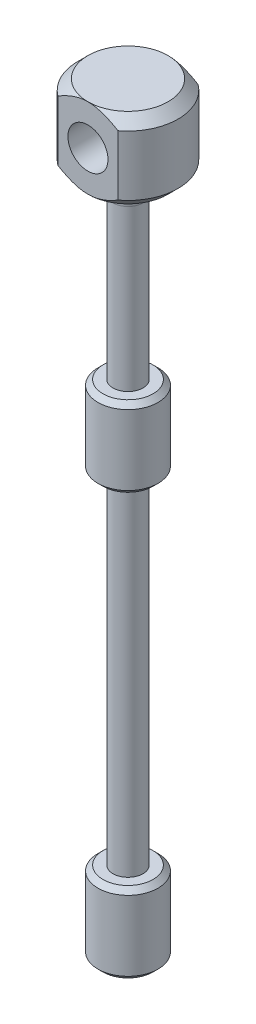
ISO-10303-21;
HEADER;
FILE_DESCRIPTION(('STEP AP214'),'2;1');
FILE_NAME('part.step','',(''),(''),'','','');
FILE_SCHEMA(('AUTOMOTIVE_DESIGN { 1 0 10303 214 1 1 1 1 }'));
ENDSEC;
DATA;
#1=APPLICATION_CONTEXT('core data for automotive mechanical design processes');
#2=APPLICATION_PROTOCOL_DEFINITION('international standard','automotive_design',2000,#1);
#3=PRODUCT_CONTEXT('',#1,'mechanical');
#4=PRODUCT('Part','Part','',(#3));
#5=PRODUCT_RELATED_PRODUCT_CATEGORY('part','',(#4));
#6=PRODUCT_DEFINITION_FORMATION('','',#4);
#7=PRODUCT_DEFINITION_CONTEXT('part definition',#1,'design');
#8=PRODUCT_DEFINITION('design','',#6,#7);
#9=PRODUCT_DEFINITION_SHAPE('','',#8);
#10=(LENGTH_UNIT() NAMED_UNIT(*) SI_UNIT(.MILLI.,.METRE.));
#11=(NAMED_UNIT(*) PLANE_ANGLE_UNIT() SI_UNIT($,.RADIAN.));
#12=(NAMED_UNIT(*) SI_UNIT($,.STERADIAN.) SOLID_ANGLE_UNIT());
#13=UNCERTAINTY_MEASURE_WITH_UNIT(LENGTH_MEASURE(1.E-05),#10,'distance_accuracy_value','');
#14=(GEOMETRIC_REPRESENTATION_CONTEXT(3) GLOBAL_UNCERTAINTY_ASSIGNED_CONTEXT((#13)) GLOBAL_UNIT_ASSIGNED_CONTEXT((#10,
#11,#12)) REPRESENTATION_CONTEXT('',''));
#15=CARTESIAN_POINT('',(0.,0.,0.));
#16=DIRECTION('',(0.,0.,1.));
#17=DIRECTION('',(1.,0.,0.));
#18=AXIS2_PLACEMENT_3D('',#15,#16,#17);
#19=CARTESIAN_POINT('',(0.,8.,0.));
#20=DIRECTION('',(0.,-1.,0.));
#21=DIRECTION('',(0.,0.,-1.));
#22=AXIS2_PLACEMENT_3D('',#19,#20,#21);
#23=CYLINDRICAL_SURFACE('',#22,3.);
#24=CARTESIAN_POINT('',(0.,7.5,0.));
#25=DIRECTION('',(0.,1.,0.));
#26=DIRECTION('',(0.,0.,1.));
#27=AXIS2_PLACEMENT_3D('',#24,#25,#26);
#28=CIRCLE('',#27,3.);
#29=CARTESIAN_POINT('',(0.,7.5,3.));
#30=VERTEX_POINT('',#29);
#31=EDGE_CURVE('E252',#30,#30,#28,.F.);
#32=ORIENTED_EDGE('',*,*,#31,.T.);
#33=EDGE_LOOP('',(#32));
#34=FACE_BOUND('',#33,.T.);
#35=CARTESIAN_POINT('',(0.,0.500000000000001,0.));
#36=DIRECTION('',(0.,1.,0.));
#37=DIRECTION('',(0.,0.,1.));
#38=AXIS2_PLACEMENT_3D('',#35,#36,#37);
#39=CIRCLE('',#38,3.);
#40=CARTESIAN_POINT('',(0.,0.500000000000001,3.));
#41=VERTEX_POINT('',#40);
#42=EDGE_CURVE('E249',#41,#41,#39,.T.);
#43=ORIENTED_EDGE('',*,*,#42,.T.);
#44=EDGE_LOOP('',(#43));
#45=FACE_BOUND('',#44,.T.);
#46=ADVANCED_FACE('F35',(#34,#45),#23,.T.);
#47=CARTESIAN_POINT('',(0.,8.,0.));
#48=DIRECTION('',(0.,1.,0.));
#49=DIRECTION('',(0.,0.,1.));
#50=AXIS2_PLACEMENT_3D('',#47,#48,#49);
#51=PLANE('',#50);
#52=CARTESIAN_POINT('',(0.,8.,0.));
#53=DIRECTION('',(0.,1.,0.));
#54=DIRECTION('',(0.,0.,1.));
#55=AXIS2_PLACEMENT_3D('',#52,#53,#54);
#56=CIRCLE('',#55,2.5);
#57=CARTESIAN_POINT('',(0.,8.,2.5));
#58=VERTEX_POINT('',#57);
#59=EDGE_CURVE('E246',#58,#58,#56,.T.);
#60=ORIENTED_EDGE('',*,*,#59,.T.);
#61=EDGE_LOOP('',(#60));
#62=FACE_BOUND('',#61,.T.);
#63=CARTESIAN_POINT('',(0.,8.,0.));
#64=DIRECTION('',(0.,1.,0.));
#65=DIRECTION('',(0.,0.,1.));
#66=AXIS2_PLACEMENT_3D('',#63,#64,#65);
#67=CIRCLE('',#66,1.5);
#68=CARTESIAN_POINT('',(0.,8.,1.5));
#69=VERTEX_POINT('',#68);
#70=EDGE_CURVE('E122',#69,#69,#67,.T.);
#71=ORIENTED_EDGE('',*,*,#70,.F.);
#72=EDGE_LOOP('',(#71));
#73=FACE_BOUND('',#72,.T.);
#74=ADVANCED_FACE('F271',(#62,#73),#51,.T.);
#75=CARTESIAN_POINT('',(0.,0.,0.));
#76=DIRECTION('',(0.,1.,0.));
#77=DIRECTION('',(0.,0.,1.));
#78=AXIS2_PLACEMENT_3D('',#75,#76,#77);
#79=PLANE('',#78);
#80=CARTESIAN_POINT('',(0.,0.,0.));
#81=DIRECTION('',(0.,1.,0.));
#82=DIRECTION('',(0.,0.,1.));
#83=AXIS2_PLACEMENT_3D('',#80,#81,#82);
#84=CIRCLE('',#83,2.5);
#85=CARTESIAN_POINT('',(0.,0.,2.5));
#86=VERTEX_POINT('',#85);
#87=EDGE_CURVE('E255',#86,#86,#84,.F.);
#88=ORIENTED_EDGE('',*,*,#87,.T.);
#89=EDGE_LOOP('',(#88));
#90=FACE_BOUND('',#89,.T.);
#91=ADVANCED_FACE('F276',(#90),#79,.F.);
#92=CARTESIAN_POINT('',(0.,42.,0.));
#93=DIRECTION('',(0.,-1.,0.));
#94=DIRECTION('',(0.,0.,-1.));
#95=AXIS2_PLACEMENT_3D('',#92,#93,#94);
#96=CYLINDRICAL_SURFACE('',#95,1.5);
#97=CARTESIAN_POINT('',(0.,42.,0.));
#98=DIRECTION('',(0.,1.,0.));
#99=DIRECTION('',(0.,0.,1.));
#100=AXIS2_PLACEMENT_3D('',#97,#98,#99);
#101=CIRCLE('',#100,1.5);
#102=CARTESIAN_POINT('',(0.,42.,1.5));
#103=VERTEX_POINT('',#102);
#104=EDGE_CURVE('E320',#103,#103,#101,.T.);
#105=ORIENTED_EDGE('',*,*,#104,.F.);
#106=EDGE_LOOP('',(#105));
#107=FACE_BOUND('',#106,.T.);
#108=ORIENTED_EDGE('',*,*,#70,.T.);
#109=EDGE_LOOP('',(#108));
#110=FACE_BOUND('',#109,.T.);
#111=ADVANCED_FACE('F282',(#107,#110),#96,.T.);
#112=CARTESIAN_POINT('',(0.,50.,0.));
#113=DIRECTION('',(0.,-1.,0.));
#114=DIRECTION('',(0.,0.,-1.));
#115=AXIS2_PLACEMENT_3D('',#112,#113,#114);
#116=CYLINDRICAL_SURFACE('',#115,3.);
#117=CARTESIAN_POINT('',(0.,49.5,0.));
#118=DIRECTION('',(0.,1.,0.));
#119=DIRECTION('',(0.,0.,1.));
#120=AXIS2_PLACEMENT_3D('',#117,#118,#119);
#121=CIRCLE('',#120,3.);
#122=CARTESIAN_POINT('',(0.,49.5,3.));
#123=VERTEX_POINT('',#122);
#124=EDGE_CURVE('E240',#123,#123,#121,.F.);
#125=ORIENTED_EDGE('',*,*,#124,.T.);
#126=EDGE_LOOP('',(#125));
#127=FACE_BOUND('',#126,.T.);
#128=CARTESIAN_POINT('',(0.,42.5,0.));
#129=DIRECTION('',(0.,1.,0.));
#130=DIRECTION('',(0.,0.,1.));
#131=AXIS2_PLACEMENT_3D('',#128,#129,#130);
#132=CIRCLE('',#131,3.);
#133=CARTESIAN_POINT('',(0.,42.5,3.));
#134=VERTEX_POINT('',#133);
#135=EDGE_CURVE('E237',#134,#134,#132,.T.);
#136=ORIENTED_EDGE('',*,*,#135,.T.);
#137=EDGE_LOOP('',(#136));
#138=FACE_BOUND('',#137,.T.);
#139=ADVANCED_FACE('F287',(#127,#138),#116,.T.);
#140=CARTESIAN_POINT('',(0.,50.,0.));
#141=DIRECTION('',(0.,1.,0.));
#142=DIRECTION('',(0.,0.,1.));
#143=AXIS2_PLACEMENT_3D('',#140,#141,#142);
#144=PLANE('',#143);
#145=CARTESIAN_POINT('',(0.,50.,0.));
#146=DIRECTION('',(0.,1.,0.));
#147=DIRECTION('',(0.,0.,1.));
#148=AXIS2_PLACEMENT_3D('',#145,#146,#147);
#149=CIRCLE('',#148,2.5);
#150=CARTESIAN_POINT('',(0.,50.,2.5));
#151=VERTEX_POINT('',#150);
#152=EDGE_CURVE('E234',#151,#151,#149,.T.);
#153=ORIENTED_EDGE('',*,*,#152,.T.);
#154=EDGE_LOOP('',(#153));
#155=FACE_BOUND('',#154,.T.);
#156=CARTESIAN_POINT('',(0.,50.,0.));
#157=DIRECTION('',(0.,1.,0.));
#158=DIRECTION('',(0.,0.,1.));
#159=AXIS2_PLACEMENT_3D('',#156,#157,#158);
#160=CIRCLE('',#159,1.5);
#161=CARTESIAN_POINT('',(0.,50.,1.5));
#162=VERTEX_POINT('',#161);
#163=EDGE_CURVE('E118',#162,#162,#160,.T.);
#164=ORIENTED_EDGE('',*,*,#163,.F.);
#165=EDGE_LOOP('',(#164));
#166=FACE_BOUND('',#165,.T.);
#167=ADVANCED_FACE('F291',(#155,#166),#144,.T.);
#168=CARTESIAN_POINT('',(0.,42.,0.));
#169=DIRECTION('',(0.,1.,0.));
#170=DIRECTION('',(0.,0.,1.));
#171=AXIS2_PLACEMENT_3D('',#168,#169,#170);
#172=PLANE('',#171);
#173=CARTESIAN_POINT('',(0.,42.,0.));
#174=DIRECTION('',(0.,1.,0.));
#175=DIRECTION('',(0.,0.,1.));
#176=AXIS2_PLACEMENT_3D('',#173,#174,#175);
#177=CIRCLE('',#176,2.49999999999999);
#178=CARTESIAN_POINT('',(0.,42.,2.49999999999999));
#179=VERTEX_POINT('',#178);
#180=EDGE_CURVE('E243',#179,#179,#177,.F.);
#181=ORIENTED_EDGE('',*,*,#180,.T.);
#182=EDGE_LOOP('',(#181));
#183=FACE_BOUND('',#182,.T.);
#184=ORIENTED_EDGE('',*,*,#104,.T.);
#185=EDGE_LOOP('',(#184));
#186=FACE_BOUND('',#185,.T.);
#187=ADVANCED_FACE('F293',(#183,#186),#172,.F.);
#188=CARTESIAN_POINT('',(0.,68.,0.));
#189=DIRECTION('',(0.,-1.,0.));
#190=DIRECTION('',(0.,0.,-1.));
#191=AXIS2_PLACEMENT_3D('',#188,#189,#190);
#192=CYLINDRICAL_SURFACE('',#191,1.5);
#193=CARTESIAN_POINT('',(0.,66.,0.));
#194=DIRECTION('',(0.,1.,0.));
#195=DIRECTION('',(0.,0.,1.));
#196=AXIS2_PLACEMENT_3D('',#193,#194,#195);
#197=CIRCLE('',#196,1.5);
#198=CARTESIAN_POINT('',(0.,66.,1.5));
#199=VERTEX_POINT('',#198);
#200=EDGE_CURVE('E11',#199,#199,#197,.F.);
#201=ORIENTED_EDGE('',*,*,#200,.T.);
#202=EDGE_LOOP('',(#201));
#203=FACE_BOUND('',#202,.T.);
#204=ORIENTED_EDGE('',*,*,#163,.T.);
#205=EDGE_LOOP('',(#204));
#206=FACE_BOUND('',#205,.T.);
#207=ADVANCED_FACE('F296',(#203,#206),#192,.T.);
#208=CARTESIAN_POINT('',(0.,76.,0.));
#209=DIRECTION('',(0.,-1.,0.));
#210=DIRECTION('',(0.,0.,-1.));
#211=AXIS2_PLACEMENT_3D('',#208,#209,#210);
#212=CYLINDRICAL_SURFACE('',#211,5.);
#213=DIRECTION('',(0.,-1.,0.));
#214=VECTOR('',#213,1.);
#215=CARTESIAN_POINT('',(-3.,76.,-4.));
#216=LINE('',#215,#214);
#217=CARTESIAN_POINT('',(-3.,75.,-4.));
#218=VERTEX_POINT('',#217);
#219=CARTESIAN_POINT('',(-3.,69.,-4.));
#220=VERTEX_POINT('',#219);
#221=EDGE_CURVE('E113',#218,#220,#216,.T.);
#222=ORIENTED_EDGE('',*,*,#221,.T.);
#223=CARTESIAN_POINT('',(0.,69.,0.));
#224=DIRECTION('',(0.,1.,0.));
#225=DIRECTION('',(0.,0.,1.));
#226=AXIS2_PLACEMENT_3D('',#223,#224,#225);
#227=CIRCLE('',#226,5.);
#228=CARTESIAN_POINT('',(-3.,69.,4.));
#229=VERTEX_POINT('',#228);
#230=EDGE_CURVE('E224',#220,#229,#227,.T.);
#231=ORIENTED_EDGE('',*,*,#230,.T.);
#232=DIRECTION('',(0.,-1.,0.));
#233=VECTOR('',#232,1.);
#234=CARTESIAN_POINT('',(-3.,76.,4.));
#235=LINE('',#234,#233);
#236=CARTESIAN_POINT('',(-3.,75.,4.));
#237=VERTEX_POINT('',#236);
#238=EDGE_CURVE('E319',#237,#229,#235,.T.);
#239=ORIENTED_EDGE('',*,*,#238,.F.);
#240=CARTESIAN_POINT('',(0.,75.,0.));
#241=DIRECTION('',(0.,1.,0.));
#242=DIRECTION('',(0.,0.,1.));
#243=AXIS2_PLACEMENT_3D('',#240,#241,#242);
#244=CIRCLE('',#243,5.);
#245=EDGE_CURVE('E227',#237,#218,#244,.F.);
#246=ORIENTED_EDGE('',*,*,#245,.T.);
#247=EDGE_LOOP('',(#222,#231,#239,#246));
#248=FACE_BOUND('',#247,.T.);
#249=ADVANCED_FACE('F204',(#248),#212,.T.);
#250=CARTESIAN_POINT('',(-3.,76.,4.));
#251=DIRECTION('',(0.,0.,-1.));
#252=DIRECTION('',(-1.,0.,0.));
#253=AXIS2_PLACEMENT_3D('',#250,#251,#252);
#254=PLANE('',#253);
#255=CARTESIAN_POINT('',(0.,72.,4.));
#256=DIRECTION('',(0.,0.,-1.));
#257=DIRECTION('',(-1.,0.,0.));
#258=AXIS2_PLACEMENT_3D('',#255,#256,#257);
#259=CIRCLE('',#258,2.);
#260=CARTESIAN_POINT('',(-2.,72.,4.));
#261=VERTEX_POINT('',#260);
#262=EDGE_CURVE('E311',#261,#261,#259,.T.);
#263=ORIENTED_EDGE('',*,*,#262,.T.);
#264=EDGE_LOOP('',(#263));
#265=FACE_BOUND('',#264,.T.);
#266=CARTESIAN_POINT('',(-3.,69.,4.));
#267=CARTESIAN_POINT('',(-2.92762836200348,68.956581405577,4.));
#268=CARTESIAN_POINT('',(-2.85481802742839,68.9138959485449,4.));
#269=CARTESIAN_POINT('',(-2.70821938275152,68.83019894129,4.));
#270=CARTESIAN_POINT('',(-2.63443084222755,68.7891877950874,4.));
#271=CARTESIAN_POINT('',(-2.41100406792378,68.6687412261486,4.));
#272=CARTESIAN_POINT('',(-2.25978602411567,68.5921850767644,4.));
#273=CARTESIAN_POINT('',(-1.95659067359726,68.450923903765,4.));
#274=CARTESIAN_POINT('',(-1.80473273623763,68.3859648909348,4.));
#275=CARTESIAN_POINT('',(-1.49644202508003,68.2683839947351,4.));
#276=CARTESIAN_POINT('',(-1.34001590275358,68.2157450905884,4.));
#277=CARTESIAN_POINT('',(-1.08612110951739,68.1438275437783,4.));
#278=CARTESIAN_POINT('',(-0.990042302625627,68.1196197271478,4.));
#279=CARTESIAN_POINT('',(-0.796520862813769,68.0774412059882,4.));
#280=CARTESIAN_POINT('',(-0.699078403289656,68.0594697158391,4.));
#281=CARTESIAN_POINT('',(-0.501704347689405,68.0301457323276,4.));
#282=CARTESIAN_POINT('',(-0.401757304518332,68.0188959865408,4.));
#283=CARTESIAN_POINT('',(-0.201215242114625,68.0037953128905,4.));
#284=CARTESIAN_POINT('',(-0.100619701668966,67.999951356772,4.));
#285=CARTESIAN_POINT('',(0.,68.,4.));
#286=B_SPLINE_CURVE_WITH_KNOTS('',3,(#266,#267,#268,#269,#270,#271,#272,#273,#274,#275,#276,
#277,#278,#279,#280,#281,#282,#283,#284,#285),.UNSPECIFIED.,.F.,.F.,(4,2,2,2,2,2,2,2,2,4),(0.,
0.253181371589514,0.506423480383851,1.01459556294123,1.50970891621841,2.00413415664268,
2.30120350256041,2.59823541162859,2.89969868702638,3.20144561888665),.UNSPECIFIED.);
#287=CARTESIAN_POINT('',(0.,68.,4.));
#288=VERTEX_POINT('',#287);
#289=EDGE_CURVE('E50',#229,#288,#286,.T.);
#290=ORIENTED_EDGE('',*,*,#289,.T.);
#291=CARTESIAN_POINT('',(0.,68.,4.));
#292=CARTESIAN_POINT('',(0.0614896821712425,67.999995048581,4.));
#293=CARTESIAN_POINT('',(0.122970237034905,68.0014185758096,4.));
#294=CARTESIAN_POINT('',(0.2457922689549,68.0070760257621,4.));
#295=CARTESIAN_POINT('',(0.307133766863006,68.0113094947052,4.));
#296=CARTESIAN_POINT('',(0.490538519574091,68.0281318667512,4.));
#297=CARTESIAN_POINT('',(0.612243847557191,68.0448431319862,4.));
#298=CARTESIAN_POINT('',(0.851773849884559,68.0880127467617,4.));
#299=CARTESIAN_POINT('',(0.969629397394424,68.1143041589317,4.));
#300=CARTESIAN_POINT('',(1.20311028898421,68.1754966667891,4.));
#301=CARTESIAN_POINT('',(1.31873469194052,68.2104013135961,4.));
#302=CARTESIAN_POINT('',(1.56915278958546,68.2948602113957,4.));
#303=CARTESIAN_POINT('',(1.70342909226877,68.3459370048148,4.));
#304=CARTESIAN_POINT('',(1.96849997837182,68.4565094208477,4.));
#305=CARTESIAN_POINT('',(2.09929282991421,68.516009141589,4.));
#306=CARTESIAN_POINT('',(2.36033095148102,68.6430430444663,4.));
#307=CARTESIAN_POINT('',(2.49050544053603,68.7107211665127,4.));
#308=CARTESIAN_POINT('',(2.74756392847844,68.8515677946968,4.));
#309=CARTESIAN_POINT('',(2.87445330157051,68.9247264560827,4.));
#310=CARTESIAN_POINT('',(3.,69.,4.));
#311=B_SPLINE_CURVE_WITH_KNOTS('',3,(#291,#292,#293,#294,#295,#296,#297,#298,#299,#300,#301,
#302,#303,#304,#305,#306,#307,#308,#309,#310),.UNSPECIFIED.,.F.,.F.,(4,2,2,2,2,2,2,2,2,4),(0.,
0.184435127504875,0.368840477618773,0.736868694951193,1.0987686824657,1.46081812644689,
1.89144466887991,2.32228145495383,2.76227942763344,3.20150515183777),.UNSPECIFIED.);
#312=CARTESIAN_POINT('',(3.,69.,4.));
#313=VERTEX_POINT('',#312);
#314=EDGE_CURVE('E189',#288,#313,#311,.T.);
#315=ORIENTED_EDGE('',*,*,#314,.T.);
#316=DIRECTION('',(0.,-1.,0.));
#317=VECTOR('',#316,1.);
#318=CARTESIAN_POINT('',(3.,76.,4.));
#319=LINE('',#318,#317);
#320=CARTESIAN_POINT('',(3.,75.,4.));
#321=VERTEX_POINT('',#320);
#322=EDGE_CURVE('E112',#321,#313,#319,.T.);
#323=ORIENTED_EDGE('',*,*,#322,.F.);
#324=CARTESIAN_POINT('',(3.,75.,4.));
#325=CARTESIAN_POINT('',(2.92762836200348,75.0434185944231,4.));
#326=CARTESIAN_POINT('',(2.85481802742839,75.0861040514551,4.));
#327=CARTESIAN_POINT('',(2.70821938275153,75.16980105871,4.));
#328=CARTESIAN_POINT('',(2.63443084222756,75.2108122049127,4.));
#329=CARTESIAN_POINT('',(2.41100406792379,75.3312587738514,4.));
#330=CARTESIAN_POINT('',(2.25978602411567,75.4078149232356,4.));
#331=CARTESIAN_POINT('',(1.95659067359726,75.549076096235,4.));
#332=CARTESIAN_POINT('',(1.80473273623763,75.6140351090652,4.));
#333=CARTESIAN_POINT('',(1.49644202508003,75.7316160052649,4.));
#334=CARTESIAN_POINT('',(1.34001590275358,75.7842549094116,4.));
#335=CARTESIAN_POINT('',(1.08612110951739,75.8561724562217,4.));
#336=CARTESIAN_POINT('',(0.990042302625627,75.8803802728522,4.));
#337=CARTESIAN_POINT('',(0.796520862813769,75.9225587940118,4.));
#338=CARTESIAN_POINT('',(0.699078403289656,75.9405302841609,4.));
#339=CARTESIAN_POINT('',(0.501704347689405,75.9698542676724,4.));
#340=CARTESIAN_POINT('',(0.401757304518332,75.9811040134592,4.));
#341=CARTESIAN_POINT('',(0.201215242114624,75.9962046871095,4.));
#342=CARTESIAN_POINT('',(0.100619701668965,76.000048643228,4.));
#343=CARTESIAN_POINT('',(0.,76.,4.));
#344=B_SPLINE_CURVE_WITH_KNOTS('',3,(#324,#325,#326,#327,#328,#329,#330,#331,#332,#333,#334,
#335,#336,#337,#338,#339,#340,#341,#342,#343),.UNSPECIFIED.,.F.,.F.,(4,2,2,2,2,2,2,2,2,4),(0.,
0.253181371589513,0.50642348038385,1.01459556294123,1.5097089162184,2.00413415664268,
2.30120350256041,2.5982354116286,2.89969868702638,3.20144561888666),.UNSPECIFIED.);
#345=CARTESIAN_POINT('',(0.,76.,4.));
#346=VERTEX_POINT('',#345);
#347=EDGE_CURVE('E117',#321,#346,#344,.T.);
#348=ORIENTED_EDGE('',*,*,#347,.T.);
#349=CARTESIAN_POINT('',(0.,76.,4.));
#350=CARTESIAN_POINT('',(-0.061489682171242,76.000004951419,4.));
#351=CARTESIAN_POINT('',(-0.122970237034905,75.9985814241904,4.));
#352=CARTESIAN_POINT('',(-0.2457922689549,75.9929239742379,4.));
#353=CARTESIAN_POINT('',(-0.307133766863006,75.9886905052948,4.));
#354=CARTESIAN_POINT('',(-0.490538519574091,75.9718681332489,4.));
#355=CARTESIAN_POINT('',(-0.61224384755719,75.9551568680138,4.));
#356=CARTESIAN_POINT('',(-0.851773849884557,75.9119872532383,4.));
#357=CARTESIAN_POINT('',(-0.96962939739442,75.8856958410683,4.));
#358=CARTESIAN_POINT('',(-1.2031102889842,75.824503333211,4.));
#359=CARTESIAN_POINT('',(-1.31873469194052,75.789598686404,4.));
#360=CARTESIAN_POINT('',(-1.56915278958545,75.7051397886043,4.));
#361=CARTESIAN_POINT('',(-1.70342909226875,75.6540629951852,4.));
#362=CARTESIAN_POINT('',(-1.9684999783718,75.5434905791523,4.));
#363=CARTESIAN_POINT('',(-2.0992928299142,75.4839908584111,4.));
#364=CARTESIAN_POINT('',(-2.36033095148101,75.3569569555337,4.));
#365=CARTESIAN_POINT('',(-2.49050544053602,75.2892788334873,4.));
#366=CARTESIAN_POINT('',(-2.74756392847844,75.1484322053032,4.));
#367=CARTESIAN_POINT('',(-2.8744533015705,75.0752735439173,4.));
#368=CARTESIAN_POINT('',(-3.,75.,4.));
#369=B_SPLINE_CURVE_WITH_KNOTS('',3,(#349,#350,#351,#352,#353,#354,#355,#356,#357,#358,#359,
#360,#361,#362,#363,#364,#365,#366,#367,#368),.UNSPECIFIED.,.F.,.F.,(4,2,2,2,2,2,2,2,2,4),(0.,
0.184435127504875,0.368840477618771,0.736868694951192,1.0987686824657,1.46081812644688,
1.89144466887989,2.32228145495381,2.76227942763344,3.20150515183777),.UNSPECIFIED.);
#370=EDGE_CURVE('E58',#346,#237,#369,.T.);
#371=ORIENTED_EDGE('',*,*,#370,.T.);
#372=ORIENTED_EDGE('',*,*,#238,.T.);
#373=EDGE_LOOP('',(#290,#315,#323,#348,#371,#372));
#374=FACE_BOUND('',#373,.T.);
#375=ADVANCED_FACE('F200',(#265,#374),#254,.F.);
#376=CARTESIAN_POINT('',(0.,76.,0.));
#377=DIRECTION('',(0.,-1.,0.));
#378=DIRECTION('',(0.,0.,-1.));
#379=AXIS2_PLACEMENT_3D('',#376,#377,#378);
#380=CYLINDRICAL_SURFACE('',#379,5.);
#381=ORIENTED_EDGE('',*,*,#322,.T.);
#382=CARTESIAN_POINT('',(0.,69.,0.));
#383=DIRECTION('',(0.,1.,0.));
#384=DIRECTION('',(0.,0.,1.));
#385=AXIS2_PLACEMENT_3D('',#382,#383,#384);
#386=CIRCLE('',#385,5.);
#387=CARTESIAN_POINT('',(3.,69.,-4.));
#388=VERTEX_POINT('',#387);
#389=EDGE_CURVE('E103',#313,#388,#386,.T.);
#390=ORIENTED_EDGE('',*,*,#389,.T.);
#391=DIRECTION('',(0.,-1.,0.));
#392=VECTOR('',#391,1.);
#393=CARTESIAN_POINT('',(3.,76.,-4.));
#394=LINE('',#393,#392);
#395=CARTESIAN_POINT('',(3.,75.,-4.));
#396=VERTEX_POINT('',#395);
#397=EDGE_CURVE('E94',#396,#388,#394,.T.);
#398=ORIENTED_EDGE('',*,*,#397,.F.);
#399=CARTESIAN_POINT('',(0.,75.,0.));
#400=DIRECTION('',(0.,1.,0.));
#401=DIRECTION('',(0.,0.,1.));
#402=AXIS2_PLACEMENT_3D('',#399,#400,#401);
#403=CIRCLE('',#402,5.);
#404=EDGE_CURVE('E109',#396,#321,#403,.F.);
#405=ORIENTED_EDGE('',*,*,#404,.T.);
#406=EDGE_LOOP('',(#381,#390,#398,#405));
#407=FACE_BOUND('',#406,.T.);
#408=ADVANCED_FACE('F108',(#407),#380,.T.);
#409=CARTESIAN_POINT('',(-3.,76.,-4.));
#410=DIRECTION('',(0.,0.,1.));
#411=DIRECTION('',(1.,0.,0.));
#412=AXIS2_PLACEMENT_3D('',#409,#410,#411);
#413=PLANE('',#412);
#414=CARTESIAN_POINT('',(0.,72.,-4.));
#415=DIRECTION('',(0.,0.,1.));
#416=DIRECTION('',(1.,0.,0.));
#417=AXIS2_PLACEMENT_3D('',#414,#415,#416);
#418=CIRCLE('',#417,2.);
#419=CARTESIAN_POINT('',(2.,72.,-4.));
#420=VERTEX_POINT('',#419);
#421=EDGE_CURVE('E314',#420,#420,#418,.T.);
#422=ORIENTED_EDGE('',*,*,#421,.T.);
#423=EDGE_LOOP('',(#422));
#424=FACE_BOUND('',#423,.T.);
#425=ORIENTED_EDGE('',*,*,#397,.T.);
#426=CARTESIAN_POINT('',(3.,69.,-4.));
#427=CARTESIAN_POINT('',(2.92762836200348,68.956581405577,-4.));
#428=CARTESIAN_POINT('',(2.85481802742839,68.9138959485449,-4.));
#429=CARTESIAN_POINT('',(2.70821938275152,68.83019894129,-4.));
#430=CARTESIAN_POINT('',(2.63443084222755,68.7891877950874,-4.));
#431=CARTESIAN_POINT('',(2.41100406792378,68.6687412261486,-4.));
#432=CARTESIAN_POINT('',(2.25978602411567,68.5921850767644,-4.));
#433=CARTESIAN_POINT('',(1.95659067359726,68.450923903765,-4.));
#434=CARTESIAN_POINT('',(1.80473273623763,68.3859648909348,-4.));
#435=CARTESIAN_POINT('',(1.49644202508003,68.2683839947351,-4.));
#436=CARTESIAN_POINT('',(1.34001590275358,68.2157450905884,-4.));
#437=CARTESIAN_POINT('',(1.08612110951739,68.1438275437783,-4.));
#438=CARTESIAN_POINT('',(0.990042302625627,68.1196197271478,-4.));
#439=CARTESIAN_POINT('',(0.796520862813769,68.0774412059882,-4.));
#440=CARTESIAN_POINT('',(0.699078403289656,68.0594697158391,-4.));
#441=CARTESIAN_POINT('',(0.501704347689405,68.0301457323276,-4.));
#442=CARTESIAN_POINT('',(0.401757304518332,68.0188959865408,-4.));
#443=CARTESIAN_POINT('',(0.201215242114625,68.0037953128905,-4.));
#444=CARTESIAN_POINT('',(0.100619701668966,67.999951356772,-4.));
#445=CARTESIAN_POINT('',(0.,68.,-4.));
#446=B_SPLINE_CURVE_WITH_KNOTS('',3,(#426,#427,#428,#429,#430,#431,#432,#433,#434,#435,#436,
#437,#438,#439,#440,#441,#442,#443,#444,#445),.UNSPECIFIED.,.F.,.F.,(4,2,2,2,2,2,2,2,2,4),(0.,
0.253181371589514,0.506423480383851,1.01459556294123,1.50970891621841,2.00413415664268,
2.30120350256041,2.59823541162859,2.89969868702638,3.20144561888665),.UNSPECIFIED.);
#447=CARTESIAN_POINT('',(0.,68.,-4.));
#448=VERTEX_POINT('',#447);
#449=EDGE_CURVE('E161',#388,#448,#446,.T.);
#450=ORIENTED_EDGE('',*,*,#449,.T.);
#451=CARTESIAN_POINT('',(0.,68.,-4.));
#452=CARTESIAN_POINT('',(-0.0614896821712425,67.999995048581,-4.));
#453=CARTESIAN_POINT('',(-0.122970237034905,68.0014185758096,-4.));
#454=CARTESIAN_POINT('',(-0.2457922689549,68.0070760257621,-4.));
#455=CARTESIAN_POINT('',(-0.307133766863006,68.0113094947052,-4.));
#456=CARTESIAN_POINT('',(-0.490538519574091,68.0281318667512,-4.));
#457=CARTESIAN_POINT('',(-0.612243847557191,68.0448431319862,-4.));
#458=CARTESIAN_POINT('',(-0.851773849884559,68.0880127467617,-4.));
#459=CARTESIAN_POINT('',(-0.969629397394424,68.1143041589317,-4.));
#460=CARTESIAN_POINT('',(-1.20311028898421,68.1754966667891,-4.));
#461=CARTESIAN_POINT('',(-1.31873469194052,68.2104013135961,-4.));
#462=CARTESIAN_POINT('',(-1.56915278958546,68.2948602113957,-4.));
#463=CARTESIAN_POINT('',(-1.70342909226877,68.3459370048148,-4.));
#464=CARTESIAN_POINT('',(-1.96849997837182,68.4565094208477,-4.));
#465=CARTESIAN_POINT('',(-2.09929282991421,68.516009141589,-4.));
#466=CARTESIAN_POINT('',(-2.36033095148102,68.6430430444663,-4.));
#467=CARTESIAN_POINT('',(-2.49050544053603,68.7107211665127,-4.));
#468=CARTESIAN_POINT('',(-2.74756392847844,68.8515677946968,-4.));
#469=CARTESIAN_POINT('',(-2.87445330157051,68.9247264560827,-4.));
#470=CARTESIAN_POINT('',(-3.,69.,-4.));
#471=B_SPLINE_CURVE_WITH_KNOTS('',3,(#451,#452,#453,#454,#455,#456,#457,#458,#459,#460,#461,
#462,#463,#464,#465,#466,#467,#468,#469,#470),.UNSPECIFIED.,.F.,.F.,(4,2,2,2,2,2,2,2,2,4),(0.,
0.184435127504875,0.368840477618773,0.736868694951193,1.0987686824657,1.46081812644689,
1.89144466887991,2.32228145495383,2.76227942763344,3.20150515183777),.UNSPECIFIED.);
#472=EDGE_CURVE('E155',#448,#220,#471,.T.);
#473=ORIENTED_EDGE('',*,*,#472,.T.);
#474=ORIENTED_EDGE('',*,*,#221,.F.);
#475=CARTESIAN_POINT('',(-3.,75.,-4.));
#476=CARTESIAN_POINT('',(-2.92762836200348,75.0434185944231,-4.));
#477=CARTESIAN_POINT('',(-2.85481802742839,75.0861040514551,-4.));
#478=CARTESIAN_POINT('',(-2.70821938275153,75.16980105871,-4.));
#479=CARTESIAN_POINT('',(-2.63443084222756,75.2108122049127,-4.));
#480=CARTESIAN_POINT('',(-2.41100406792379,75.3312587738514,-4.));
#481=CARTESIAN_POINT('',(-2.25978602411567,75.4078149232356,-4.));
#482=CARTESIAN_POINT('',(-1.95659067359726,75.549076096235,-4.));
#483=CARTESIAN_POINT('',(-1.80473273623763,75.6140351090652,-4.));
#484=CARTESIAN_POINT('',(-1.49644202508003,75.7316160052649,-4.));
#485=CARTESIAN_POINT('',(-1.34001590275358,75.7842549094116,-4.));
#486=CARTESIAN_POINT('',(-1.08612110951739,75.8561724562217,-4.));
#487=CARTESIAN_POINT('',(-0.990042302625627,75.8803802728522,-4.));
#488=CARTESIAN_POINT('',(-0.796520862813769,75.9225587940118,-4.));
#489=CARTESIAN_POINT('',(-0.699078403289656,75.9405302841609,-4.));
#490=CARTESIAN_POINT('',(-0.501704347689405,75.9698542676724,-4.));
#491=CARTESIAN_POINT('',(-0.401757304518332,75.9811040134592,-4.));
#492=CARTESIAN_POINT('',(-0.201215242114624,75.9962046871095,-4.));
#493=CARTESIAN_POINT('',(-0.100619701668965,76.000048643228,-4.));
#494=CARTESIAN_POINT('',(0.,76.,-4.));
#495=B_SPLINE_CURVE_WITH_KNOTS('',3,(#475,#476,#477,#478,#479,#480,#481,#482,#483,#484,#485,
#486,#487,#488,#489,#490,#491,#492,#493,#494),.UNSPECIFIED.,.F.,.F.,(4,2,2,2,2,2,2,2,2,4),(0.,
0.253181371589513,0.50642348038385,1.01459556294123,1.5097089162184,2.00413415664268,
2.30120350256041,2.5982354116286,2.89969868702638,3.20144561888666),.UNSPECIFIED.);
#496=CARTESIAN_POINT('',(0.,76.,-4.));
#497=VERTEX_POINT('',#496);
#498=EDGE_CURVE('E97',#218,#497,#495,.T.);
#499=ORIENTED_EDGE('',*,*,#498,.T.);
#500=CARTESIAN_POINT('',(0.,76.,-4.));
#501=CARTESIAN_POINT('',(0.061489682171242,76.000004951419,-4.));
#502=CARTESIAN_POINT('',(0.122970237034905,75.9985814241904,-4.));
#503=CARTESIAN_POINT('',(0.2457922689549,75.9929239742379,-4.));
#504=CARTESIAN_POINT('',(0.307133766863006,75.9886905052948,-4.));
#505=CARTESIAN_POINT('',(0.490538519574091,75.9718681332489,-4.));
#506=CARTESIAN_POINT('',(0.61224384755719,75.9551568680138,-4.));
#507=CARTESIAN_POINT('',(0.851773849884557,75.9119872532383,-4.));
#508=CARTESIAN_POINT('',(0.96962939739442,75.8856958410683,-4.));
#509=CARTESIAN_POINT('',(1.2031102889842,75.824503333211,-4.));
#510=CARTESIAN_POINT('',(1.31873469194052,75.789598686404,-4.));
#511=CARTESIAN_POINT('',(1.56915278958545,75.7051397886043,-4.));
#512=CARTESIAN_POINT('',(1.70342909226875,75.6540629951852,-4.));
#513=CARTESIAN_POINT('',(1.9684999783718,75.5434905791523,-4.));
#514=CARTESIAN_POINT('',(2.0992928299142,75.4839908584111,-4.));
#515=CARTESIAN_POINT('',(2.36033095148101,75.3569569555337,-4.));
#516=CARTESIAN_POINT('',(2.49050544053602,75.2892788334873,-4.));
#517=CARTESIAN_POINT('',(2.74756392847844,75.1484322053032,-4.));
#518=CARTESIAN_POINT('',(2.8744533015705,75.0752735439173,-4.));
#519=CARTESIAN_POINT('',(3.,75.,-4.));
#520=B_SPLINE_CURVE_WITH_KNOTS('',3,(#500,#501,#502,#503,#504,#505,#506,#507,#508,#509,#510,
#511,#512,#513,#514,#515,#516,#517,#518,#519),.UNSPECIFIED.,.F.,.F.,(4,2,2,2,2,2,2,2,2,4),(0.,
0.184435127504875,0.368840477618771,0.736868694951192,1.0987686824657,1.46081812644688,
1.89144466887989,2.32228145495381,2.76227942763344,3.20150515183777),.UNSPECIFIED.);
#521=EDGE_CURVE('E90',#497,#396,#520,.T.);
#522=ORIENTED_EDGE('',*,*,#521,.T.);
#523=EDGE_LOOP('',(#425,#450,#473,#474,#499,#522));
#524=FACE_BOUND('',#523,.T.);
#525=ADVANCED_FACE('F92',(#424,#524),#413,.F.);
#526=CARTESIAN_POINT('',(0.,76.,0.));
#527=DIRECTION('',(0.,1.,0.));
#528=DIRECTION('',(0.,0.,1.));
#529=AXIS2_PLACEMENT_3D('',#526,#527,#528);
#530=PLANE('',#529);
#531=CARTESIAN_POINT('',(0.,76.,0.));
#532=DIRECTION('',(0.,1.,0.));
#533=DIRECTION('',(0.,0.,1.));
#534=AXIS2_PLACEMENT_3D('',#531,#532,#533);
#535=CIRCLE('',#534,4.);
#536=EDGE_CURVE('E226',#346,#497,#535,.T.);
#537=ORIENTED_EDGE('',*,*,#536,.T.);
#538=CARTESIAN_POINT('',(0.,76.,0.));
#539=DIRECTION('',(0.,1.,0.));
#540=DIRECTION('',(0.,0.,1.));
#541=AXIS2_PLACEMENT_3D('',#538,#539,#540);
#542=CIRCLE('',#541,4.);
#543=EDGE_CURVE('E229',#497,#346,#542,.T.);
#544=ORIENTED_EDGE('',*,*,#543,.T.);
#545=EDGE_LOOP('',(#537,#544));
#546=FACE_BOUND('',#545,.T.);
#547=ADVANCED_FACE('F146',(#546),#530,.T.);
#548=CARTESIAN_POINT('',(0.,68.,0.));
#549=DIRECTION('',(0.,1.,0.));
#550=DIRECTION('',(0.,0.,1.));
#551=AXIS2_PLACEMENT_3D('',#548,#549,#550);
#552=PLANE('',#551);
#553=CARTESIAN_POINT('',(0.,68.,0.));
#554=DIRECTION('',(0.,1.,0.));
#555=DIRECTION('',(0.,0.,1.));
#556=AXIS2_PLACEMENT_3D('',#553,#554,#555);
#557=CIRCLE('',#556,3.5);
#558=CARTESIAN_POINT('',(0.,68.,3.5));
#559=VERTEX_POINT('',#558);
#560=EDGE_CURVE('E43',#559,#559,#557,.T.);
#561=ORIENTED_EDGE('',*,*,#560,.T.);
#562=EDGE_LOOP('',(#561));
#563=FACE_BOUND('',#562,.T.);
#564=CARTESIAN_POINT('',(0.,68.,0.));
#565=DIRECTION('',(0.,1.,0.));
#566=DIRECTION('',(0.,0.,1.));
#567=AXIS2_PLACEMENT_3D('',#564,#565,#566);
#568=CIRCLE('',#567,4.);
#569=EDGE_CURVE('E217',#288,#448,#568,.F.);
#570=ORIENTED_EDGE('',*,*,#569,.T.);
#571=CARTESIAN_POINT('',(0.,68.,0.));
#572=DIRECTION('',(0.,1.,0.));
#573=DIRECTION('',(0.,0.,1.));
#574=AXIS2_PLACEMENT_3D('',#571,#572,#573);
#575=CIRCLE('',#574,4.);
#576=EDGE_CURVE('E215',#448,#288,#575,.F.);
#577=ORIENTED_EDGE('',*,*,#576,.T.);
#578=EDGE_LOOP('',(#570,#577));
#579=FACE_BOUND('',#578,.T.);
#580=ADVANCED_FACE('F148',(#563,#579),#552,.F.);
#581=CARTESIAN_POINT('',(0.,72.,-4.));
#582=DIRECTION('',(0.,0.,1.));
#583=DIRECTION('',(1.,0.,0.));
#584=AXIS2_PLACEMENT_3D('',#581,#582,#583);
#585=CYLINDRICAL_SURFACE('',#584,2.);
#586=ORIENTED_EDGE('',*,*,#421,.F.);
#587=EDGE_LOOP('',(#586));
#588=FACE_BOUND('',#587,.T.);
#589=ORIENTED_EDGE('',*,*,#262,.F.);
#590=EDGE_LOOP('',(#589));
#591=FACE_BOUND('',#590,.T.);
#592=ADVANCED_FACE('F334',(#588,#591),#585,.F.);
#593=CARTESIAN_POINT('',(0.,69.,0.));
#594=DIRECTION('',(0.,1.,0.));
#595=DIRECTION('',(0.,0.,1.));
#596=AXIS2_PLACEMENT_3D('',#593,#594,#595);
#597=CONICAL_SURFACE('',#596,5.,0.785398163397443);
#598=ORIENTED_EDGE('',*,*,#314,.F.);
#599=ORIENTED_EDGE('',*,*,#576,.F.);
#600=ORIENTED_EDGE('',*,*,#449,.F.);
#601=ORIENTED_EDGE('',*,*,#389,.F.);
#602=EDGE_LOOP('',(#598,#599,#600,#601));
#603=FACE_BOUND('',#602,.T.);
#604=ADVANCED_FACE('F177',(#603),#597,.T.);
#605=CARTESIAN_POINT('',(0.,69.,0.));
#606=DIRECTION('',(0.,1.,0.));
#607=DIRECTION('',(0.,0.,1.));
#608=AXIS2_PLACEMENT_3D('',#605,#606,#607);
#609=CONICAL_SURFACE('',#608,5.,0.785398163397443);
#610=ORIENTED_EDGE('',*,*,#472,.F.);
#611=ORIENTED_EDGE('',*,*,#569,.F.);
#612=ORIENTED_EDGE('',*,*,#289,.F.);
#613=ORIENTED_EDGE('',*,*,#230,.F.);
#614=EDGE_LOOP('',(#610,#611,#612,#613));
#615=FACE_BOUND('',#614,.T.);
#616=ADVANCED_FACE('F169',(#615),#609,.T.);
#617=CARTESIAN_POINT('',(0.,76.,0.));
#618=DIRECTION('',(0.,-1.,0.));
#619=DIRECTION('',(0.,0.,-1.));
#620=AXIS2_PLACEMENT_3D('',#617,#618,#619);
#621=CONICAL_SURFACE('',#620,4.,0.785398163397439);
#622=ORIENTED_EDGE('',*,*,#498,.F.);
#623=ORIENTED_EDGE('',*,*,#245,.F.);
#624=ORIENTED_EDGE('',*,*,#370,.F.);
#625=ORIENTED_EDGE('',*,*,#543,.F.);
#626=EDGE_LOOP('',(#622,#623,#624,#625));
#627=FACE_BOUND('',#626,.T.);
#628=ADVANCED_FACE('F176',(#627),#621,.T.);
#629=CARTESIAN_POINT('',(0.,76.,0.));
#630=DIRECTION('',(0.,-1.,0.));
#631=DIRECTION('',(0.,0.,-1.));
#632=AXIS2_PLACEMENT_3D('',#629,#630,#631);
#633=CONICAL_SURFACE('',#632,4.,0.785398163397439);
#634=ORIENTED_EDGE('',*,*,#347,.F.);
#635=ORIENTED_EDGE('',*,*,#404,.F.);
#636=ORIENTED_EDGE('',*,*,#521,.F.);
#637=ORIENTED_EDGE('',*,*,#536,.F.);
#638=EDGE_LOOP('',(#634,#635,#636,#637));
#639=FACE_BOUND('',#638,.T.);
#640=ADVANCED_FACE('F116',(#639),#633,.T.);
#641=CARTESIAN_POINT('',(0.,50.,0.));
#642=DIRECTION('',(0.,-1.,0.));
#643=DIRECTION('',(0.,0.,-1.));
#644=AXIS2_PLACEMENT_3D('',#641,#642,#643);
#645=CONICAL_SURFACE('',#644,2.5,0.785398163397446);
#646=ORIENTED_EDGE('',*,*,#124,.F.);
#647=EDGE_LOOP('',(#646));
#648=FACE_BOUND('',#647,.T.);
#649=ORIENTED_EDGE('',*,*,#152,.F.);
#650=EDGE_LOOP('',(#649));
#651=FACE_BOUND('',#650,.T.);
#652=ADVANCED_FACE('F362',(#648,#651),#645,.T.);
#653=CARTESIAN_POINT('',(0.,42.5,0.));
#654=DIRECTION('',(0.,1.,0.));
#655=DIRECTION('',(0.,0.,1.));
#656=AXIS2_PLACEMENT_3D('',#653,#654,#655);
#657=CONICAL_SURFACE('',#656,3.,0.785398163397446);
#658=ORIENTED_EDGE('',*,*,#180,.F.);
#659=EDGE_LOOP('',(#658));
#660=FACE_BOUND('',#659,.T.);
#661=ORIENTED_EDGE('',*,*,#135,.F.);
#662=EDGE_LOOP('',(#661));
#663=FACE_BOUND('',#662,.T.);
#664=ADVANCED_FACE('F368',(#660,#663),#657,.T.);
#665=CARTESIAN_POINT('',(0.,8.,0.));
#666=DIRECTION('',(0.,-1.,0.));
#667=DIRECTION('',(0.,0.,-1.));
#668=AXIS2_PLACEMENT_3D('',#665,#666,#667);
#669=CONICAL_SURFACE('',#668,2.5,0.785398163397445);
#670=ORIENTED_EDGE('',*,*,#31,.F.);
#671=EDGE_LOOP('',(#670));
#672=FACE_BOUND('',#671,.T.);
#673=ORIENTED_EDGE('',*,*,#59,.F.);
#674=EDGE_LOOP('',(#673));
#675=FACE_BOUND('',#674,.T.);
#676=ADVANCED_FACE('F267',(#672,#675),#669,.T.);
#677=CARTESIAN_POINT('',(0.,0.500000000000001,0.));
#678=DIRECTION('',(0.,1.,0.));
#679=DIRECTION('',(0.,0.,1.));
#680=AXIS2_PLACEMENT_3D('',#677,#678,#679);
#681=CONICAL_SURFACE('',#680,3.,0.785398163397452);
#682=ORIENTED_EDGE('',*,*,#87,.F.);
#683=EDGE_LOOP('',(#682));
#684=FACE_BOUND('',#683,.T.);
#685=ORIENTED_EDGE('',*,*,#42,.F.);
#686=EDGE_LOOP('',(#685));
#687=FACE_BOUND('',#686,.T.);
#688=ADVANCED_FACE('F262',(#684,#687),#681,.T.);
#689=CARTESIAN_POINT('',(0.,66.,0.));
#690=DIRECTION('',(0.,1.,0.));
#691=DIRECTION('',(0.,0.,1.));
#692=AXIS2_PLACEMENT_3D('',#689,#690,#691);
#693=TOROIDAL_SURFACE('',#692,3.5,2.);
#694=ORIENTED_EDGE('',*,*,#200,.F.);
#695=EDGE_LOOP('',(#694));
#696=FACE_BOUND('',#695,.T.);
#697=ORIENTED_EDGE('',*,*,#560,.F.);
#698=EDGE_LOOP('',(#697));
#699=FACE_BOUND('',#698,.T.);
#700=ADVANCED_FACE('F37',(#696,#699),#693,.F.);
#701=CLOSED_SHELL('',(#46,#74,#91,#111,#139,#167,#187,#207,#249,#375,#408,#525,#547,#580,#592,
#604,#616,#628,#640,#652,#664,#676,#688,#700));
#702=MANIFOLD_SOLID_BREP('B2',#701);
#703=ADVANCED_BREP_SHAPE_REPRESENTATION('',(#18,#702),#14);
#704=SHAPE_DEFINITION_REPRESENTATION(#9,#703);
ENDSEC;
END-ISO-10303-21;
